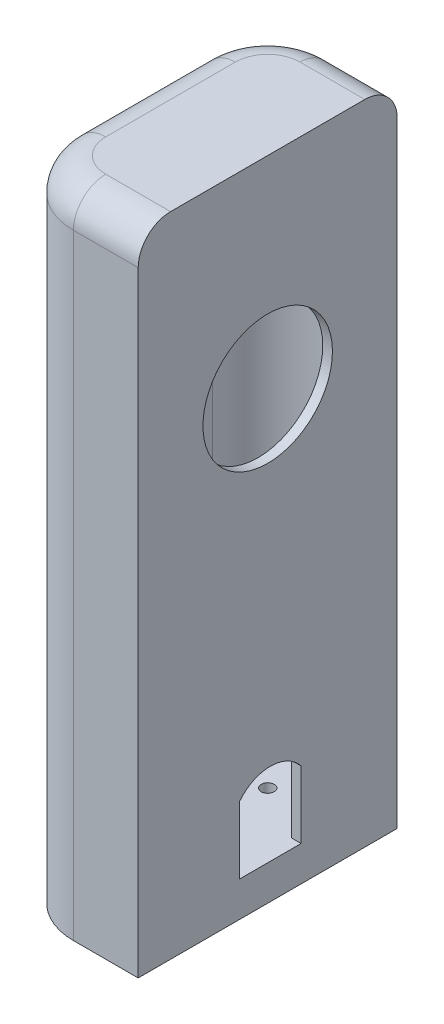
ISO-10303-21;
HEADER;
FILE_DESCRIPTION(('STEP AP214'),'2;1');
FILE_NAME('part.step','',(''),(''),'','','');
FILE_SCHEMA(('AUTOMOTIVE_DESIGN { 1 0 10303 214 1 1 1 1 }'));
ENDSEC;
DATA;
#1=APPLICATION_CONTEXT('core data for automotive mechanical design processes');
#2=APPLICATION_PROTOCOL_DEFINITION('international standard','automotive_design',2000,#1);
#3=PRODUCT_CONTEXT('',#1,'mechanical');
#4=PRODUCT('Part','Part','',(#3));
#5=PRODUCT_RELATED_PRODUCT_CATEGORY('part','',(#4));
#6=PRODUCT_DEFINITION_FORMATION('','',#4);
#7=PRODUCT_DEFINITION_CONTEXT('part definition',#1,'design');
#8=PRODUCT_DEFINITION('design','',#6,#7);
#9=PRODUCT_DEFINITION_SHAPE('','',#8);
#10=(LENGTH_UNIT() NAMED_UNIT(*) SI_UNIT(.MILLI.,.METRE.));
#11=(NAMED_UNIT(*) PLANE_ANGLE_UNIT() SI_UNIT($,.RADIAN.));
#12=(NAMED_UNIT(*) SI_UNIT($,.STERADIAN.) SOLID_ANGLE_UNIT());
#13=UNCERTAINTY_MEASURE_WITH_UNIT(LENGTH_MEASURE(1.E-05),#10,'distance_accuracy_value','');
#14=(GEOMETRIC_REPRESENTATION_CONTEXT(3) GLOBAL_UNCERTAINTY_ASSIGNED_CONTEXT((#13)) GLOBAL_UNIT_ASSIGNED_CONTEXT((#10,
#11,#12)) REPRESENTATION_CONTEXT('',''));
#15=CARTESIAN_POINT('',(0.,0.,0.));
#16=DIRECTION('',(0.,0.,1.));
#17=DIRECTION('',(1.,0.,0.));
#18=AXIS2_PLACEMENT_3D('',#15,#16,#17);
#19=CARTESIAN_POINT('',(-1.54523260009126,68.83,0.409186028532317));
#20=DIRECTION('',(1.,0.,0.));
#21=DIRECTION('',(0.,0.,-1.));
#22=AXIS2_PLACEMENT_3D('',#19,#20,#21);
#23=CYLINDRICAL_SURFACE('',#22,10.);
#24=CARTESIAN_POINT('',(5.95476739990874,68.83,0.409186028532317));
#25=DIRECTION('',(1.,0.,0.));
#26=DIRECTION('',(0.,0.,-1.));
#27=AXIS2_PLACEMENT_3D('',#24,#25,#26);
#28=CIRCLE('',#27,10.);
#29=CARTESIAN_POINT('',(5.95476739990874,68.83,-9.59081397146768));
#30=VERTEX_POINT('',#29);
#31=EDGE_CURVE('E257',#30,#30,#28,.T.);
#32=ORIENTED_EDGE('',*,*,#31,.T.);
#33=EDGE_LOOP('',(#32));
#34=FACE_BOUND('',#33,.T.);
#35=CARTESIAN_POINT('',(4.45476739990874,68.83,0.409186028532317));
#36=DIRECTION('',(-1.,0.,0.));
#37=DIRECTION('',(0.,0.,1.));
#38=AXIS2_PLACEMENT_3D('',#35,#36,#37);
#39=CIRCLE('',#38,10.);
#40=CARTESIAN_POINT('',(4.45476739990874,68.83,10.4091860285323));
#41=VERTEX_POINT('',#40);
#42=EDGE_CURVE('E217',#41,#41,#39,.F.);
#43=ORIENTED_EDGE('',*,*,#42,.F.);
#44=EDGE_LOOP('',(#43));
#45=FACE_BOUND('',#44,.T.);
#46=ADVANCED_FACE('F39',(#34,#45),#23,.F.);
#47=CARTESIAN_POINT('',(-14.0452326000913,68.83,0.409186028532317));
#48=DIRECTION('',(1.,0.,0.));
#49=DIRECTION('',(0.,0.,-1.));
#50=AXIS2_PLACEMENT_3D('',#47,#48,#49);
#51=CIRCLE('',#50,10.);
#52=CARTESIAN_POINT('',(-14.0452326000913,68.83,10.4091860285323));
#53=VERTEX_POINT('',#52);
#54=CARTESIAN_POINT('',(-14.0452326000913,68.83,-9.59081397146761));
#55=VERTEX_POINT('',#54);
#56=EDGE_CURVE('E234',#53,#55,#51,.T.);
#57=ORIENTED_EDGE('',*,*,#56,.F.);
#58=EDGE_CURVE('E237',#55,#53,#51,.T.);
#59=ORIENTED_EDGE('',*,*,#58,.F.);
#60=EDGE_LOOP('',(#57,#59));
#61=FACE_BOUND('',#60,.T.);
#62=CARTESIAN_POINT('',(-12.5452326000913,68.83,0.409186028532317));
#63=DIRECTION('',(1.,0.,0.));
#64=DIRECTION('',(0.,0.,-1.));
#65=AXIS2_PLACEMENT_3D('',#62,#63,#64);
#66=CIRCLE('',#65,10.);
#67=CARTESIAN_POINT('',(-12.5452326000913,68.83,-9.59081397146762));
#68=VERTEX_POINT('',#67);
#69=CARTESIAN_POINT('',(-12.5452326000913,68.83,10.4091860285322));
#70=VERTEX_POINT('',#69);
#71=EDGE_CURVE('E11',#68,#70,#66,.F.);
#72=ORIENTED_EDGE('',*,*,#71,.F.);
#73=EDGE_CURVE('E43',#70,#68,#66,.F.);
#74=ORIENTED_EDGE('',*,*,#73,.F.);
#75=EDGE_LOOP('',(#72,#74));
#76=FACE_BOUND('',#75,.T.);
#77=ADVANCED_FACE('F348',(#61,#76),#23,.F.);
#78=CARTESIAN_POINT('',(0.,0.,4.75));
#79=DIRECTION('',(0.,0.,-1.));
#80=DIRECTION('',(-1.,0.,0.));
#81=AXIS2_PLACEMENT_3D('',#78,#79,#80);
#82=PLANE('',#81);
#83=DIRECTION('',(1.,0.,0.));
#84=VECTOR('',#83,1.);
#85=CARTESIAN_POINT('',(3.45476739990875,5.40971585696016,4.75));
#86=LINE('',#85,#84);
#87=CARTESIAN_POINT('',(4.45476739990874,5.40971585696016,4.75));
#88=VERTEX_POINT('',#87);
#89=CARTESIAN_POINT('',(5.95476739990874,5.40971585696017,4.75));
#90=VERTEX_POINT('',#89);
#91=EDGE_CURVE('E252',#88,#90,#86,.T.);
#92=ORIENTED_EDGE('',*,*,#91,.F.);
#93=DIRECTION('',(0.,1.,0.));
#94=VECTOR('',#93,1.);
#95=CARTESIAN_POINT('',(4.45476739990874,0.,4.75));
#96=LINE('',#95,#94);
#97=CARTESIAN_POINT('',(4.45476739990875,15.7775721125282,4.75));
#98=VERTEX_POINT('',#97);
#99=EDGE_CURVE('E209',#88,#98,#96,.T.);
#100=ORIENTED_EDGE('',*,*,#99,.T.);
#101=DIRECTION('',(1.,0.,0.));
#102=VECTOR('',#101,1.);
#103=CARTESIAN_POINT('',(0.954767399908745,15.7775721125282,4.75));
#104=LINE('',#103,#102);
#105=CARTESIAN_POINT('',(5.95476739990874,15.7775721125282,4.75));
#106=VERTEX_POINT('',#105);
#107=EDGE_CURVE('E230',#98,#106,#104,.T.);
#108=ORIENTED_EDGE('',*,*,#107,.T.);
#109=DIRECTION('',(0.,-1.,0.));
#110=VECTOR('',#109,1.);
#111=CARTESIAN_POINT('',(5.95476739990874,100.,4.75));
#112=LINE('',#111,#110);
#113=EDGE_CURVE('E245',#106,#90,#112,.T.);
#114=ORIENTED_EDGE('',*,*,#113,.T.);
#115=EDGE_LOOP('',(#92,#100,#108,#114));
#116=FACE_BOUND('',#115,.T.);
#117=ADVANCED_FACE('F350',(#116),#82,.T.);
#118=CARTESIAN_POINT('',(0.,0.,-4.75));
#119=DIRECTION('',(0.,0.,-1.));
#120=DIRECTION('',(-1.,0.,0.));
#121=AXIS2_PLACEMENT_3D('',#118,#119,#120);
#122=PLANE('',#121);
#123=DIRECTION('',(0.,1.,0.));
#124=VECTOR('',#123,1.);
#125=CARTESIAN_POINT('',(4.45476739990874,0.,-4.75));
#126=LINE('',#125,#124);
#127=CARTESIAN_POINT('',(4.45476739990874,5.40971585696016,-4.75));
#128=VERTEX_POINT('',#127);
#129=CARTESIAN_POINT('',(4.45476739990875,15.7775721125282,-4.74999999999999));
#130=VERTEX_POINT('',#129);
#131=EDGE_CURVE('E62',#128,#130,#126,.T.);
#132=ORIENTED_EDGE('',*,*,#131,.F.);
#133=DIRECTION('',(1.,0.,0.));
#134=VECTOR('',#133,1.);
#135=CARTESIAN_POINT('',(3.45476739990875,5.40971585696016,-4.75));
#136=LINE('',#135,#134);
#137=CARTESIAN_POINT('',(5.95476739990874,5.40971585696017,-4.75));
#138=VERTEX_POINT('',#137);
#139=EDGE_CURVE('E255',#128,#138,#136,.T.);
#140=ORIENTED_EDGE('',*,*,#139,.T.);
#141=DIRECTION('',(0.,1.,0.));
#142=VECTOR('',#141,1.);
#143=CARTESIAN_POINT('',(5.95476739990874,100.,-4.75));
#144=LINE('',#143,#142);
#145=CARTESIAN_POINT('',(5.95476739990874,15.7775721125282,-4.74999999999999));
#146=VERTEX_POINT('',#145);
#147=EDGE_CURVE('E239',#138,#146,#144,.T.);
#148=ORIENTED_EDGE('',*,*,#147,.T.);
#149=DIRECTION('',(1.,0.,0.));
#150=VECTOR('',#149,1.);
#151=CARTESIAN_POINT('',(0.954767399908745,15.7775721125282,-4.74999999999999));
#152=LINE('',#151,#150);
#153=EDGE_CURVE('E229',#130,#146,#152,.T.);
#154=ORIENTED_EDGE('',*,*,#153,.F.);
#155=EDGE_LOOP('',(#132,#140,#148,#154));
#156=FACE_BOUND('',#155,.T.);
#157=ADVANCED_FACE('F357',(#156),#122,.F.);
#158=CARTESIAN_POINT('',(-4.04523260009126,6.,10.4091860285323));
#159=DIRECTION('',(0.,-1.,0.));
#160=DIRECTION('',(0.,0.,-1.));
#161=AXIS2_PLACEMENT_3D('',#158,#159,#160);
#162=CYLINDRICAL_SURFACE('',#161,1.);
#163=CARTESIAN_POINT('',(-4.04523260009126,0.,10.4091860285323));
#164=DIRECTION('',(0.,-1.,0.));
#165=DIRECTION('',(0.,0.,-1.));
#166=AXIS2_PLACEMENT_3D('',#163,#164,#165);
#167=CIRCLE('',#166,1.);
#168=CARTESIAN_POINT('',(-4.04523260009126,0.,9.40918602853232));
#169=VERTEX_POINT('',#168);
#170=EDGE_CURVE('E248',#169,#169,#167,.T.);
#171=ORIENTED_EDGE('',*,*,#170,.T.);
#172=EDGE_LOOP('',(#171));
#173=FACE_BOUND('',#172,.T.);
#174=CARTESIAN_POINT('',(-4.04523260009126,5.40971585696016,10.4091860285323));
#175=DIRECTION('',(0.,1.,0.));
#176=DIRECTION('',(0.,0.,1.));
#177=AXIS2_PLACEMENT_3D('',#174,#175,#176);
#178=CIRCLE('',#177,1.);
#179=CARTESIAN_POINT('',(-4.04523260009126,5.40971585696016,11.4091860285323));
#180=VERTEX_POINT('',#179);
#181=EDGE_CURVE('E223',#180,#180,#178,.F.);
#182=ORIENTED_EDGE('',*,*,#181,.F.);
#183=EDGE_LOOP('',(#182));
#184=FACE_BOUND('',#183,.T.);
#185=ADVANCED_FACE('F462',(#173,#184),#162,.F.);
#186=CARTESIAN_POINT('',(-4.04523260009126,6.,-9.59081397146768));
#187=DIRECTION('',(0.,-1.,0.));
#188=DIRECTION('',(0.,0.,-1.));
#189=AXIS2_PLACEMENT_3D('',#186,#187,#188);
#190=CYLINDRICAL_SURFACE('',#189,1.);
#191=CARTESIAN_POINT('',(-4.04523260009126,0.,-9.59081397146768));
#192=DIRECTION('',(0.,-1.,0.));
#193=DIRECTION('',(0.,0.,-1.));
#194=AXIS2_PLACEMENT_3D('',#191,#192,#193);
#195=CIRCLE('',#194,1.);
#196=CARTESIAN_POINT('',(-4.04523260009126,0.,-10.5908139714677));
#197=VERTEX_POINT('',#196);
#198=EDGE_CURVE('E249',#197,#197,#195,.T.);
#199=ORIENTED_EDGE('',*,*,#198,.T.);
#200=EDGE_LOOP('',(#199));
#201=FACE_BOUND('',#200,.T.);
#202=CARTESIAN_POINT('',(-4.04523260009126,5.40971585696016,-9.59081397146768));
#203=DIRECTION('',(0.,1.,0.));
#204=DIRECTION('',(0.,0.,1.));
#205=AXIS2_PLACEMENT_3D('',#202,#203,#204);
#206=CIRCLE('',#205,1.);
#207=CARTESIAN_POINT('',(-4.04523260009126,5.40971585696016,-8.59081397146768));
#208=VERTEX_POINT('',#207);
#209=EDGE_CURVE('E220',#208,#208,#206,.F.);
#210=ORIENTED_EDGE('',*,*,#209,.F.);
#211=EDGE_LOOP('',(#210));
#212=FACE_BOUND('',#211,.T.);
#213=ADVANCED_FACE('F456',(#201,#212),#190,.F.);
#214=CARTESIAN_POINT('',(-16.3282200888741,12.1162414245237,0.));
#215=DIRECTION('',(1.,0.,0.));
#216=DIRECTION('',(0.,0.,-1.));
#217=AXIS2_PLACEMENT_3D('',#214,#215,#216);
#218=CYLINDRICAL_SURFACE('',#217,5.99731960186579);
#219=CARTESIAN_POINT('',(4.45476739990875,12.1162414245237,0.));
#220=DIRECTION('',(-1.,0.,0.));
#221=DIRECTION('',(0.,0.,1.));
#222=AXIS2_PLACEMENT_3D('',#219,#220,#221);
#223=CIRCLE('',#222,5.99731960186579);
#224=EDGE_CURVE('E321',#130,#98,#223,.F.);
#225=ORIENTED_EDGE('',*,*,#224,.F.);
#226=ORIENTED_EDGE('',*,*,#153,.T.);
#227=CARTESIAN_POINT('',(5.95476739990874,12.1162414245237,0.));
#228=DIRECTION('',(1.,0.,0.));
#229=DIRECTION('',(0.,0.,1.));
#230=AXIS2_PLACEMENT_3D('',#227,#228,#229);
#231=CIRCLE('',#230,5.99731960186579);
#232=EDGE_CURVE('E226',#146,#106,#231,.T.);
#233=ORIENTED_EDGE('',*,*,#232,.T.);
#234=ORIENTED_EDGE('',*,*,#107,.F.);
#235=EDGE_LOOP('',(#225,#226,#233,#234));
#236=FACE_BOUND('',#235,.T.);
#237=ADVANCED_FACE('F452',(#236),#218,.F.);
#238=CARTESIAN_POINT('',(-14.0452326000913,100.,0.));
#239=DIRECTION('',(1.,0.,0.));
#240=DIRECTION('',(0.,0.,-1.));
#241=AXIS2_PLACEMENT_3D('',#238,#239,#240);
#242=PLANE('',#241);
#243=DIRECTION('',(0.,-1.,0.));
#244=VECTOR('',#243,1.);
#245=CARTESIAN_POINT('',(-14.0452326000913,100.,10.4091860285323));
#246=LINE('',#245,#244);
#247=CARTESIAN_POINT('',(-14.0452326000913,95.,10.4091860285323));
#248=VERTEX_POINT('',#247);
#249=EDGE_CURVE('E289',#248,#53,#246,.T.);
#250=ORIENTED_EDGE('',*,*,#249,.F.);
#251=DIRECTION('',(0.,0.,1.));
#252=VECTOR('',#251,1.);
#253=CARTESIAN_POINT('',(-14.0452326000913,95.,-9.59081397146761));
#254=LINE('',#253,#252);
#255=CARTESIAN_POINT('',(-14.0452326000913,95.,-9.59081397146761));
#256=VERTEX_POINT('',#255);
#257=EDGE_CURVE('E319',#248,#256,#254,.F.);
#258=ORIENTED_EDGE('',*,*,#257,.T.);
#259=DIRECTION('',(0.,-1.,0.));
#260=VECTOR('',#259,1.);
#261=CARTESIAN_POINT('',(-14.0452326000913,100.,-9.59081397146761));
#262=LINE('',#261,#260);
#263=EDGE_CURVE('E292',#256,#55,#262,.T.);
#264=ORIENTED_EDGE('',*,*,#263,.T.);
#265=ORIENTED_EDGE('',*,*,#58,.T.);
#266=EDGE_LOOP('',(#250,#258,#264,#265));
#267=FACE_BOUND('',#266,.T.);
#268=ADVANCED_FACE('F378',(#267),#242,.F.);
#269=CARTESIAN_POINT('',(5.95476739990874,100.,0.));
#270=DIRECTION('',(1.,0.,0.));
#271=DIRECTION('',(0.,0.,-1.));
#272=AXIS2_PLACEMENT_3D('',#269,#270,#271);
#273=PLANE('',#272);
#274=ORIENTED_EDGE('',*,*,#232,.F.);
#275=ORIENTED_EDGE('',*,*,#147,.F.);
#276=DIRECTION('',(0.,0.,-1.));
#277=VECTOR('',#276,1.);
#278=CARTESIAN_POINT('',(5.95476739990874,5.40971585696017,0.));
#279=LINE('',#278,#277);
#280=EDGE_CURVE('E242',#90,#138,#279,.T.);
#281=ORIENTED_EDGE('',*,*,#280,.F.);
#282=ORIENTED_EDGE('',*,*,#113,.F.);
#283=EDGE_LOOP('',(#274,#275,#281,#282));
#284=FACE_BOUND('',#283,.T.);
#285=ORIENTED_EDGE('',*,*,#31,.F.);
#286=EDGE_LOOP('',(#285));
#287=FACE_BOUND('',#286,.T.);
#288=DIRECTION('',(0.,-1.,0.));
#289=VECTOR('',#288,1.);
#290=CARTESIAN_POINT('',(5.95476739990873,100.,-19.5908139714677));
#291=LINE('',#290,#289);
#292=CARTESIAN_POINT('',(5.95476739990873,95.,-19.5908139714677));
#293=VERTEX_POINT('',#292);
#294=CARTESIAN_POINT('',(5.95476739990873,0.,-19.5908139714677));
#295=VERTEX_POINT('',#294);
#296=EDGE_CURVE('E265',#293,#295,#291,.T.);
#297=ORIENTED_EDGE('',*,*,#296,.F.);
#298=CARTESIAN_POINT('',(5.95476739990874,95.,-14.5908139714677));
#299=DIRECTION('',(1.,0.,0.));
#300=DIRECTION('',(0.,0.,-1.));
#301=AXIS2_PLACEMENT_3D('',#298,#299,#300);
#302=CIRCLE('',#301,5.);
#303=CARTESIAN_POINT('',(5.95476739990874,100.,-14.5908139714677));
#304=VERTEX_POINT('',#303);
#305=EDGE_CURVE('E301',#293,#304,#302,.T.);
#306=ORIENTED_EDGE('',*,*,#305,.T.);
#307=DIRECTION('',(0.,0.,1.));
#308=VECTOR('',#307,1.);
#309=CARTESIAN_POINT('',(5.95476739990874,100.,0.));
#310=LINE('',#309,#308);
#311=CARTESIAN_POINT('',(5.95476739990874,100.,15.4091860285323));
#312=VERTEX_POINT('',#311);
#313=EDGE_CURVE('E262',#304,#312,#310,.T.);
#314=ORIENTED_EDGE('',*,*,#313,.T.);
#315=CARTESIAN_POINT('',(5.95476739990874,95.,15.4091860285323));
#316=DIRECTION('',(1.,0.,0.));
#317=DIRECTION('',(0.,0.,-1.));
#318=AXIS2_PLACEMENT_3D('',#315,#316,#317);
#319=CIRCLE('',#318,5.);
#320=CARTESIAN_POINT('',(5.95476739990874,95.,20.4091860285323));
#321=VERTEX_POINT('',#320);
#322=EDGE_CURVE('E299',#312,#321,#319,.T.);
#323=ORIENTED_EDGE('',*,*,#322,.T.);
#324=DIRECTION('',(0.,-1.,0.));
#325=VECTOR('',#324,1.);
#326=CARTESIAN_POINT('',(5.95476739990874,100.,20.4091860285323));
#327=LINE('',#326,#325);
#328=CARTESIAN_POINT('',(5.95476739990874,0.,20.4091860285323));
#329=VERTEX_POINT('',#328);
#330=EDGE_CURVE('E284',#321,#329,#327,.T.);
#331=ORIENTED_EDGE('',*,*,#330,.T.);
#332=DIRECTION('',(0.,0.,1.));
#333=VECTOR('',#332,1.);
#334=CARTESIAN_POINT('',(5.95476739990874,0.,0.));
#335=LINE('',#334,#333);
#336=EDGE_CURVE('E266',#295,#329,#335,.T.);
#337=ORIENTED_EDGE('',*,*,#336,.F.);
#338=EDGE_LOOP('',(#297,#306,#314,#323,#331,#337));
#339=FACE_BOUND('',#338,.T.);
#340=ADVANCED_FACE('F374',(#284,#287,#339),#273,.T.);
#341=CARTESIAN_POINT('',(0.,100.,-19.5908139714677));
#342=DIRECTION('',(0.,0.,-1.));
#343=DIRECTION('',(-1.,0.,0.));
#344=AXIS2_PLACEMENT_3D('',#341,#342,#343);
#345=PLANE('',#344);
#346=DIRECTION('',(0.,-1.,0.));
#347=VECTOR('',#346,1.);
#348=CARTESIAN_POINT('',(-4.04523260009119,100.,-19.5908139714677));
#349=LINE('',#348,#347);
#350=CARTESIAN_POINT('',(-4.04523260009119,95.,-19.5908139714677));
#351=VERTEX_POINT('',#350);
#352=CARTESIAN_POINT('',(-4.04523260009119,0.,-19.5908139714677));
#353=VERTEX_POINT('',#352);
#354=EDGE_CURVE('E294',#351,#353,#349,.T.);
#355=ORIENTED_EDGE('',*,*,#354,.F.);
#356=DIRECTION('',(1.,0.,0.));
#357=VECTOR('',#356,1.);
#358=CARTESIAN_POINT('',(0.,95.,-19.5908139714677));
#359=LINE('',#358,#357);
#360=EDGE_CURVE('E296',#351,#293,#359,.T.);
#361=ORIENTED_EDGE('',*,*,#360,.T.);
#362=ORIENTED_EDGE('',*,*,#296,.T.);
#363=DIRECTION('',(1.,0.,0.));
#364=VECTOR('',#363,1.);
#365=CARTESIAN_POINT('',(0.,0.,-19.5908139714677));
#366=LINE('',#365,#364);
#367=EDGE_CURVE('E261',#353,#295,#366,.T.);
#368=ORIENTED_EDGE('',*,*,#367,.F.);
#369=EDGE_LOOP('',(#355,#361,#362,#368));
#370=FACE_BOUND('',#369,.T.);
#371=ADVANCED_FACE('F377',(#370),#345,.T.);
#372=CARTESIAN_POINT('',(-4.04523260009126,100.,-9.59081397146768));
#373=DIRECTION('',(0.,-1.,0.));
#374=DIRECTION('',(0.,0.,-1.));
#375=AXIS2_PLACEMENT_3D('',#372,#373,#374);
#376=CYLINDRICAL_SURFACE('',#375,10.);
#377=ORIENTED_EDGE('',*,*,#263,.F.);
#378=CARTESIAN_POINT('',(-4.04523260009126,95.,-9.59081397146768));
#379=DIRECTION('',(0.,1.,0.));
#380=DIRECTION('',(0.,0.,1.));
#381=AXIS2_PLACEMENT_3D('',#378,#379,#380);
#382=CIRCLE('',#381,10.);
#383=EDGE_CURVE('E313',#256,#351,#382,.F.);
#384=ORIENTED_EDGE('',*,*,#383,.T.);
#385=ORIENTED_EDGE('',*,*,#354,.T.);
#386=CARTESIAN_POINT('',(-4.04523260009126,0.,-9.59081397146768));
#387=DIRECTION('',(0.,1.,0.));
#388=DIRECTION('',(0.,0.,1.));
#389=AXIS2_PLACEMENT_3D('',#386,#387,#388);
#390=CIRCLE('',#389,10.);
#391=CARTESIAN_POINT('',(-14.0452326000913,0.,-9.59081397146761));
#392=VERTEX_POINT('',#391);
#393=EDGE_CURVE('E269',#353,#392,#390,.T.);
#394=ORIENTED_EDGE('',*,*,#393,.T.);
#395=EDGE_CURVE('E291',#55,#392,#262,.T.);
#396=ORIENTED_EDGE('',*,*,#395,.F.);
#397=EDGE_LOOP('',(#377,#384,#385,#394,#396));
#398=FACE_BOUND('',#397,.T.);
#399=ADVANCED_FACE('F390',(#398),#376,.T.);
#400=CARTESIAN_POINT('',(-14.0452326000913,0.,10.4091860285323));
#401=VERTEX_POINT('',#400);
#402=EDGE_CURVE('E288',#53,#401,#246,.T.);
#403=ORIENTED_EDGE('',*,*,#402,.F.);
#404=ORIENTED_EDGE('',*,*,#56,.T.);
#405=ORIENTED_EDGE('',*,*,#395,.T.);
#406=DIRECTION('',(0.,0.,1.));
#407=VECTOR('',#406,1.);
#408=CARTESIAN_POINT('',(-14.0452326000913,0.,0.));
#409=LINE('',#408,#407);
#410=EDGE_CURVE('E272',#392,#401,#409,.T.);
#411=ORIENTED_EDGE('',*,*,#410,.T.);
#412=EDGE_LOOP('',(#403,#404,#405,#411));
#413=FACE_BOUND('',#412,.T.);
#414=ADVANCED_FACE('F386',(#413),#242,.F.);
#415=CARTESIAN_POINT('',(-4.04523260009126,100.,10.4091860285323));
#416=DIRECTION('',(0.,-1.,0.));
#417=DIRECTION('',(0.,0.,-1.));
#418=AXIS2_PLACEMENT_3D('',#415,#416,#417);
#419=CYLINDRICAL_SURFACE('',#418,10.);
#420=DIRECTION('',(0.,-1.,0.));
#421=VECTOR('',#420,1.);
#422=CARTESIAN_POINT('',(-4.04523260009119,100.,20.4091860285323));
#423=LINE('',#422,#421);
#424=CARTESIAN_POINT('',(-4.04523260009119,95.,20.4091860285323));
#425=VERTEX_POINT('',#424);
#426=CARTESIAN_POINT('',(-4.04523260009119,0.,20.4091860285323));
#427=VERTEX_POINT('',#426);
#428=EDGE_CURVE('E286',#425,#427,#423,.T.);
#429=ORIENTED_EDGE('',*,*,#428,.F.);
#430=CARTESIAN_POINT('',(-4.04523260009126,95.,10.4091860285323));
#431=DIRECTION('',(0.,1.,0.));
#432=DIRECTION('',(0.,0.,1.));
#433=AXIS2_PLACEMENT_3D('',#430,#431,#432);
#434=CIRCLE('',#433,10.);
#435=EDGE_CURVE('E317',#425,#248,#434,.F.);
#436=ORIENTED_EDGE('',*,*,#435,.T.);
#437=ORIENTED_EDGE('',*,*,#249,.T.);
#438=ORIENTED_EDGE('',*,*,#402,.T.);
#439=CARTESIAN_POINT('',(-4.04523260009126,0.,10.4091860285323));
#440=DIRECTION('',(0.,1.,0.));
#441=DIRECTION('',(0.,0.,1.));
#442=AXIS2_PLACEMENT_3D('',#439,#440,#441);
#443=CIRCLE('',#442,10.);
#444=EDGE_CURVE('E275',#401,#427,#443,.T.);
#445=ORIENTED_EDGE('',*,*,#444,.T.);
#446=EDGE_LOOP('',(#429,#436,#437,#438,#445));
#447=FACE_BOUND('',#446,.T.);
#448=ADVANCED_FACE('F382',(#447),#419,.T.);
#449=CARTESIAN_POINT('',(0.,100.,20.4091860285323));
#450=DIRECTION('',(0.,0.,-1.));
#451=DIRECTION('',(-1.,0.,0.));
#452=AXIS2_PLACEMENT_3D('',#449,#450,#451);
#453=PLANE('',#452);
#454=ORIENTED_EDGE('',*,*,#330,.F.);
#455=DIRECTION('',(1.,0.,0.));
#456=VECTOR('',#455,1.);
#457=CARTESIAN_POINT('',(-4.04523260009119,95.,20.4091860285323));
#458=LINE('',#457,#456);
#459=EDGE_CURVE('E315',#321,#425,#458,.F.);
#460=ORIENTED_EDGE('',*,*,#459,.T.);
#461=ORIENTED_EDGE('',*,*,#428,.T.);
#462=DIRECTION('',(1.,0.,0.));
#463=VECTOR('',#462,1.);
#464=CARTESIAN_POINT('',(0.,0.,20.4091860285323));
#465=LINE('',#464,#463);
#466=EDGE_CURVE('E278',#427,#329,#465,.T.);
#467=ORIENTED_EDGE('',*,*,#466,.T.);
#468=EDGE_LOOP('',(#454,#460,#461,#467));
#469=FACE_BOUND('',#468,.T.);
#470=ADVANCED_FACE('F369',(#469),#453,.F.);
#471=CARTESIAN_POINT('',(0.,100.,0.));
#472=DIRECTION('',(0.,1.,0.));
#473=DIRECTION('',(0.,0.,1.));
#474=AXIS2_PLACEMENT_3D('',#471,#472,#473);
#475=PLANE('',#474);
#476=ORIENTED_EDGE('',*,*,#313,.F.);
#477=DIRECTION('',(1.,0.,0.));
#478=VECTOR('',#477,1.);
#479=CARTESIAN_POINT('',(0.,100.,-14.5908139714677));
#480=LINE('',#479,#478);
#481=CARTESIAN_POINT('',(-4.04523260009119,100.,-14.5908139714677));
#482=VERTEX_POINT('',#481);
#483=EDGE_CURVE('E311',#304,#482,#480,.F.);
#484=ORIENTED_EDGE('',*,*,#483,.T.);
#485=CARTESIAN_POINT('',(-4.04523260009126,100.,-9.59081397146768));
#486=DIRECTION('',(0.,1.,0.));
#487=DIRECTION('',(0.,0.,1.));
#488=AXIS2_PLACEMENT_3D('',#485,#486,#487);
#489=CIRCLE('',#488,5.);
#490=CARTESIAN_POINT('',(-9.04523260009126,100.,-9.59081397146764));
#491=VERTEX_POINT('',#490);
#492=EDGE_CURVE('E309',#482,#491,#489,.T.);
#493=ORIENTED_EDGE('',*,*,#492,.T.);
#494=DIRECTION('',(0.,0.,1.));
#495=VECTOR('',#494,1.);
#496=CARTESIAN_POINT('',(-9.04523260009126,100.,10.4091860285323));
#497=LINE('',#496,#495);
#498=CARTESIAN_POINT('',(-9.04523260009126,100.,10.4091860285323));
#499=VERTEX_POINT('',#498);
#500=EDGE_CURVE('E303',#491,#499,#497,.T.);
#501=ORIENTED_EDGE('',*,*,#500,.T.);
#502=CARTESIAN_POINT('',(-4.04523260009126,100.,10.4091860285323));
#503=DIRECTION('',(0.,1.,0.));
#504=DIRECTION('',(0.,0.,1.));
#505=AXIS2_PLACEMENT_3D('',#502,#503,#504);
#506=CIRCLE('',#505,5.);
#507=CARTESIAN_POINT('',(-4.04523260009119,100.,15.4091860285323));
#508=VERTEX_POINT('',#507);
#509=EDGE_CURVE('E305',#499,#508,#506,.T.);
#510=ORIENTED_EDGE('',*,*,#509,.T.);
#511=DIRECTION('',(1.,0.,0.));
#512=VECTOR('',#511,1.);
#513=CARTESIAN_POINT('',(5.95476739990874,100.,15.4091860285323));
#514=LINE('',#513,#512);
#515=EDGE_CURVE('E307',#508,#312,#514,.T.);
#516=ORIENTED_EDGE('',*,*,#515,.T.);
#517=EDGE_LOOP('',(#476,#484,#493,#501,#510,#516));
#518=FACE_BOUND('',#517,.T.);
#519=ADVANCED_FACE('F365',(#518),#475,.T.);
#520=CARTESIAN_POINT('',(0.,0.,0.));
#521=DIRECTION('',(0.,1.,0.));
#522=DIRECTION('',(0.,0.,1.));
#523=AXIS2_PLACEMENT_3D('',#520,#521,#522);
#524=PLANE('',#523);
#525=ORIENTED_EDGE('',*,*,#198,.F.);
#526=EDGE_LOOP('',(#525));
#527=FACE_BOUND('',#526,.T.);
#528=ORIENTED_EDGE('',*,*,#170,.F.);
#529=EDGE_LOOP('',(#528));
#530=FACE_BOUND('',#529,.T.);
#531=ORIENTED_EDGE('',*,*,#367,.T.);
#532=ORIENTED_EDGE('',*,*,#336,.T.);
#533=ORIENTED_EDGE('',*,*,#466,.F.);
#534=ORIENTED_EDGE('',*,*,#444,.F.);
#535=ORIENTED_EDGE('',*,*,#410,.F.);
#536=ORIENTED_EDGE('',*,*,#393,.F.);
#537=EDGE_LOOP('',(#531,#532,#533,#534,#535,#536));
#538=FACE_BOUND('',#537,.T.);
#539=ADVANCED_FACE('F368',(#527,#530,#538),#524,.F.);
#540=CARTESIAN_POINT('',(3.45476739990875,5.40971585696016,-4.75));
#541=DIRECTION('',(0.,-1.,0.));
#542=DIRECTION('',(0.,0.,-1.));
#543=AXIS2_PLACEMENT_3D('',#540,#541,#542);
#544=PLANE('',#543);
#545=DIRECTION('',(0.,0.,-1.));
#546=VECTOR('',#545,1.);
#547=CARTESIAN_POINT('',(4.45476739990874,5.40971585696016,0.));
#548=LINE('',#547,#546);
#549=CARTESIAN_POINT('',(4.45476739990874,5.40971585696016,18.9091860285323));
#550=VERTEX_POINT('',#549);
#551=EDGE_CURVE('E488',#550,#88,#548,.T.);
#552=ORIENTED_EDGE('',*,*,#551,.T.);
#553=ORIENTED_EDGE('',*,*,#91,.T.);
#554=ORIENTED_EDGE('',*,*,#280,.T.);
#555=ORIENTED_EDGE('',*,*,#139,.F.);
#556=CARTESIAN_POINT('',(4.45476739990874,5.40971585696016,-18.0908139714677));
#557=VERTEX_POINT('',#556);
#558=EDGE_CURVE('E480',#128,#557,#548,.T.);
#559=ORIENTED_EDGE('',*,*,#558,.T.);
#560=DIRECTION('',(-1.,0.,0.));
#561=VECTOR('',#560,1.);
#562=CARTESIAN_POINT('',(0.,5.40971585696016,-18.0908139714677));
#563=LINE('',#562,#561);
#564=CARTESIAN_POINT('',(-4.04523260009119,5.40971585696016,-18.0908139714677));
#565=VERTEX_POINT('',#564);
#566=EDGE_CURVE('E206',#557,#565,#563,.T.);
#567=ORIENTED_EDGE('',*,*,#566,.T.);
#568=CARTESIAN_POINT('',(-4.04523260009126,5.40971585696016,-9.59081397146768));
#569=DIRECTION('',(0.,1.,0.));
#570=DIRECTION('',(0.,0.,1.));
#571=AXIS2_PLACEMENT_3D('',#568,#569,#570);
#572=CIRCLE('',#571,8.5);
#573=CARTESIAN_POINT('',(-12.5452326000913,5.40971585696016,-9.59081397146762));
#574=VERTEX_POINT('',#573);
#575=EDGE_CURVE('E491',#565,#574,#572,.T.);
#576=ORIENTED_EDGE('',*,*,#575,.T.);
#577=DIRECTION('',(0.,0.,1.));
#578=VECTOR('',#577,1.);
#579=CARTESIAN_POINT('',(-12.5452326000913,5.40971585696016,0.));
#580=LINE('',#579,#578);
#581=CARTESIAN_POINT('',(-12.5452326000913,5.40971585696016,10.4091860285323));
#582=VERTEX_POINT('',#581);
#583=EDGE_CURVE('E343',#574,#582,#580,.T.);
#584=ORIENTED_EDGE('',*,*,#583,.T.);
#585=CARTESIAN_POINT('',(-4.04523260009126,5.40971585696016,10.4091860285323));
#586=DIRECTION('',(0.,1.,0.));
#587=DIRECTION('',(0.,0.,1.));
#588=AXIS2_PLACEMENT_3D('',#585,#586,#587);
#589=CIRCLE('',#588,8.5);
#590=CARTESIAN_POINT('',(-4.04523260009121,5.40971585696016,18.9091860285323));
#591=VERTEX_POINT('',#590);
#592=EDGE_CURVE('E499',#582,#591,#589,.T.);
#593=ORIENTED_EDGE('',*,*,#592,.T.);
#594=DIRECTION('',(1.,0.,0.));
#595=VECTOR('',#594,1.);
#596=CARTESIAN_POINT('',(0.,5.40971585696016,18.9091860285323));
#597=LINE('',#596,#595);
#598=EDGE_CURVE('E202',#591,#550,#597,.T.);
#599=ORIENTED_EDGE('',*,*,#598,.T.);
#600=EDGE_LOOP('',(#552,#553,#554,#555,#559,#567,#576,#584,#593,#599));
#601=FACE_BOUND('',#600,.T.);
#602=ORIENTED_EDGE('',*,*,#209,.T.);
#603=EDGE_LOOP('',(#602));
#604=FACE_BOUND('',#603,.T.);
#605=ORIENTED_EDGE('',*,*,#181,.T.);
#606=EDGE_LOOP('',(#605));
#607=FACE_BOUND('',#606,.T.);
#608=ADVANCED_FACE('F364',(#601,#604,#607),#544,.F.);
#609=CARTESIAN_POINT('',(0.,95.,15.4091860285323));
#610=DIRECTION('',(-1.,0.,0.));
#611=DIRECTION('',(0.,0.,1.));
#612=AXIS2_PLACEMENT_3D('',#609,#610,#611);
#613=CYLINDRICAL_SURFACE('',#612,5.);
#614=ORIENTED_EDGE('',*,*,#322,.F.);
#615=ORIENTED_EDGE('',*,*,#515,.F.);
#616=CARTESIAN_POINT('',(-4.04523260009119,95.,15.4091860285323));
#617=DIRECTION('',(-1.,0.,0.));
#618=DIRECTION('',(0.,0.,1.));
#619=AXIS2_PLACEMENT_3D('',#616,#617,#618);
#620=CIRCLE('',#619,5.);
#621=EDGE_CURVE('E238',#425,#508,#620,.T.);
#622=ORIENTED_EDGE('',*,*,#621,.F.);
#623=ORIENTED_EDGE('',*,*,#459,.F.);
#624=EDGE_LOOP('',(#614,#615,#622,#623));
#625=FACE_BOUND('',#624,.T.);
#626=ADVANCED_FACE('F41',(#625),#613,.T.);
#627=CARTESIAN_POINT('',(-4.04523260009126,95.,10.4091860285323));
#628=DIRECTION('',(0.,1.,0.));
#629=DIRECTION('',(0.,0.,1.));
#630=AXIS2_PLACEMENT_3D('',#627,#628,#629);
#631=DEGENERATE_TOROIDAL_SURFACE('',#630,5.,5.,.T.);
#632=ORIENTED_EDGE('',*,*,#621,.T.);
#633=ORIENTED_EDGE('',*,*,#509,.F.);
#634=CARTESIAN_POINT('',(-9.04523260009126,95.,10.4091860285323));
#635=DIRECTION('',(0.,0.,-1.));
#636=DIRECTION('',(-1.,0.,0.));
#637=AXIS2_PLACEMENT_3D('',#634,#635,#636);
#638=CIRCLE('',#637,5.);
#639=EDGE_CURVE('E327',#248,#499,#638,.T.);
#640=ORIENTED_EDGE('',*,*,#639,.F.);
#641=ORIENTED_EDGE('',*,*,#435,.F.);
#642=EDGE_LOOP('',(#632,#633,#640,#641));
#643=FACE_BOUND('',#642,.T.);
#644=ADVANCED_FACE('F408',(#643),#631,.T.);
#645=CARTESIAN_POINT('',(-9.04523260009126,95.,0.));
#646=DIRECTION('',(0.,0.,-1.));
#647=DIRECTION('',(-1.,0.,0.));
#648=AXIS2_PLACEMENT_3D('',#645,#646,#647);
#649=CYLINDRICAL_SURFACE('',#648,5.);
#650=ORIENTED_EDGE('',*,*,#639,.T.);
#651=ORIENTED_EDGE('',*,*,#500,.F.);
#652=CARTESIAN_POINT('',(-9.04523260009126,95.,-9.59081397146761));
#653=DIRECTION('',(0.,0.,-1.));
#654=DIRECTION('',(0.,1.,0.));
#655=AXIS2_PLACEMENT_3D('',#652,#653,#654);
#656=CIRCLE('',#655,5.);
#657=EDGE_CURVE('E324',#256,#491,#656,.T.);
#658=ORIENTED_EDGE('',*,*,#657,.F.);
#659=ORIENTED_EDGE('',*,*,#257,.F.);
#660=EDGE_LOOP('',(#650,#651,#658,#659));
#661=FACE_BOUND('',#660,.T.);
#662=ADVANCED_FACE('F405',(#661),#649,.T.);
#663=CARTESIAN_POINT('',(-4.04523260009126,95.,-9.59081397146768));
#664=DIRECTION('',(0.,1.,0.));
#665=DIRECTION('',(0.,0.,1.));
#666=AXIS2_PLACEMENT_3D('',#663,#664,#665);
#667=DEGENERATE_TOROIDAL_SURFACE('',#666,5.,5.,.T.);
#668=ORIENTED_EDGE('',*,*,#657,.T.);
#669=ORIENTED_EDGE('',*,*,#492,.F.);
#670=CARTESIAN_POINT('',(-4.04523260009123,95.,-14.5908139714677));
#671=DIRECTION('',(1.,0.,0.));
#672=DIRECTION('',(0.,0.,-1.));
#673=AXIS2_PLACEMENT_3D('',#670,#671,#672);
#674=CIRCLE('',#673,5.);
#675=EDGE_CURVE('E232',#351,#482,#674,.T.);
#676=ORIENTED_EDGE('',*,*,#675,.F.);
#677=ORIENTED_EDGE('',*,*,#383,.F.);
#678=EDGE_LOOP('',(#668,#669,#676,#677));
#679=FACE_BOUND('',#678,.T.);
#680=ADVANCED_FACE('F401',(#679),#667,.T.);
#681=CARTESIAN_POINT('',(0.,95.,-14.5908139714677));
#682=DIRECTION('',(1.,0.,0.));
#683=DIRECTION('',(0.,0.,-1.));
#684=AXIS2_PLACEMENT_3D('',#681,#682,#683);
#685=CYLINDRICAL_SURFACE('',#684,5.);
#686=ORIENTED_EDGE('',*,*,#675,.T.);
#687=ORIENTED_EDGE('',*,*,#483,.F.);
#688=ORIENTED_EDGE('',*,*,#305,.F.);
#689=ORIENTED_EDGE('',*,*,#360,.F.);
#690=EDGE_LOOP('',(#686,#687,#688,#689));
#691=FACE_BOUND('',#690,.T.);
#692=ADVANCED_FACE('F398',(#691),#685,.T.);
#693=CARTESIAN_POINT('',(-12.5452326000913,95.4097158569602,0.));
#694=DIRECTION('',(1.,0.,0.));
#695=DIRECTION('',(0.,0.,-1.));
#696=AXIS2_PLACEMENT_3D('',#693,#694,#695);
#697=PLANE('',#696);
#698=ORIENTED_EDGE('',*,*,#71,.T.);
#699=DIRECTION('',(0.,-1.,0.));
#700=VECTOR('',#699,1.);
#701=CARTESIAN_POINT('',(-12.5452326000913,95.4097158569602,10.4091860285323));
#702=LINE('',#701,#700);
#703=EDGE_CURVE('E506',#70,#582,#702,.T.);
#704=ORIENTED_EDGE('',*,*,#703,.T.);
#705=ORIENTED_EDGE('',*,*,#583,.F.);
#706=DIRECTION('',(0.,-1.,0.));
#707=VECTOR('',#706,1.);
#708=CARTESIAN_POINT('',(-12.5452326000913,95.4097158569602,-9.59081397146762));
#709=LINE('',#708,#707);
#710=EDGE_CURVE('E340',#68,#574,#709,.T.);
#711=ORIENTED_EDGE('',*,*,#710,.F.);
#712=EDGE_LOOP('',(#698,#704,#705,#711));
#713=FACE_BOUND('',#712,.T.);
#714=ADVANCED_FACE('F341',(#713),#697,.T.);
#715=ORIENTED_EDGE('',*,*,#73,.T.);
#716=CARTESIAN_POINT('',(-12.5452326000913,95.4097158569602,-9.59081397146762));
#717=VERTEX_POINT('',#716);
#718=EDGE_CURVE('E211',#717,#68,#709,.T.);
#719=ORIENTED_EDGE('',*,*,#718,.F.);
#720=DIRECTION('',(0.,0.,1.));
#721=VECTOR('',#720,1.);
#722=CARTESIAN_POINT('',(-12.5452326000913,95.4097158569602,0.));
#723=LINE('',#722,#721);
#724=CARTESIAN_POINT('',(-12.5452326000913,95.4097158569602,10.4091860285323));
#725=VERTEX_POINT('',#724);
#726=EDGE_CURVE('E515',#717,#725,#723,.T.);
#727=ORIENTED_EDGE('',*,*,#726,.T.);
#728=EDGE_CURVE('E54',#725,#70,#702,.T.);
#729=ORIENTED_EDGE('',*,*,#728,.T.);
#730=EDGE_LOOP('',(#715,#719,#727,#729));
#731=FACE_BOUND('',#730,.T.);
#732=ADVANCED_FACE('F334',(#731),#697,.T.);
#733=CARTESIAN_POINT('',(4.45476739990874,95.4097158569602,0.));
#734=DIRECTION('',(-1.,0.,0.));
#735=DIRECTION('',(0.,0.,1.));
#736=AXIS2_PLACEMENT_3D('',#733,#734,#735);
#737=PLANE('',#736);
#738=ORIENTED_EDGE('',*,*,#551,.F.);
#739=DIRECTION('',(0.,-1.,0.));
#740=VECTOR('',#739,1.);
#741=CARTESIAN_POINT('',(4.45476739990874,95.4097158569602,18.9091860285323));
#742=LINE('',#741,#740);
#743=CARTESIAN_POINT('',(4.45476739990874,95.4097158569602,18.9091860285323));
#744=VERTEX_POINT('',#743);
#745=EDGE_CURVE('E201',#744,#550,#742,.T.);
#746=ORIENTED_EDGE('',*,*,#745,.F.);
#747=DIRECTION('',(0.,0.,-1.));
#748=VECTOR('',#747,1.);
#749=CARTESIAN_POINT('',(4.45476739990874,95.4097158569602,0.));
#750=LINE('',#749,#748);
#751=CARTESIAN_POINT('',(4.45476739990874,95.4097158569602,-18.0908139714677));
#752=VERTEX_POINT('',#751);
#753=EDGE_CURVE('E186',#744,#752,#750,.T.);
#754=ORIENTED_EDGE('',*,*,#753,.T.);
#755=DIRECTION('',(0.,-1.,0.));
#756=VECTOR('',#755,1.);
#757=CARTESIAN_POINT('',(4.45476739990874,95.4097158569602,-18.0908139714677));
#758=LINE('',#757,#756);
#759=EDGE_CURVE('E199',#752,#557,#758,.T.);
#760=ORIENTED_EDGE('',*,*,#759,.T.);
#761=ORIENTED_EDGE('',*,*,#558,.F.);
#762=ORIENTED_EDGE('',*,*,#131,.T.);
#763=ORIENTED_EDGE('',*,*,#224,.T.);
#764=ORIENTED_EDGE('',*,*,#99,.F.);
#765=EDGE_LOOP('',(#738,#746,#754,#760,#761,#762,#763,#764));
#766=FACE_BOUND('',#765,.T.);
#767=ORIENTED_EDGE('',*,*,#42,.T.);
#768=EDGE_LOOP('',(#767));
#769=FACE_BOUND('',#768,.T.);
#770=ADVANCED_FACE('F197',(#766,#769),#737,.T.);
#771=CARTESIAN_POINT('',(0.,95.4097158569602,-18.0908139714677));
#772=DIRECTION('',(0.,0.,1.));
#773=DIRECTION('',(1.,0.,0.));
#774=AXIS2_PLACEMENT_3D('',#771,#772,#773);
#775=PLANE('',#774);
#776=ORIENTED_EDGE('',*,*,#566,.F.);
#777=ORIENTED_EDGE('',*,*,#759,.F.);
#778=DIRECTION('',(-1.,0.,0.));
#779=VECTOR('',#778,1.);
#780=CARTESIAN_POINT('',(0.,95.4097158569602,-18.0908139714677));
#781=LINE('',#780,#779);
#782=CARTESIAN_POINT('',(-4.04523260009119,95.4097158569602,-18.0908139714677));
#783=VERTEX_POINT('',#782);
#784=EDGE_CURVE('E182',#752,#783,#781,.T.);
#785=ORIENTED_EDGE('',*,*,#784,.T.);
#786=DIRECTION('',(0.,-1.,0.));
#787=VECTOR('',#786,1.);
#788=CARTESIAN_POINT('',(-4.04523260009119,95.4097158569602,-18.0908139714677));
#789=LINE('',#788,#787);
#790=EDGE_CURVE('E207',#783,#565,#789,.T.);
#791=ORIENTED_EDGE('',*,*,#790,.T.);
#792=EDGE_LOOP('',(#776,#777,#785,#791));
#793=FACE_BOUND('',#792,.T.);
#794=ADVANCED_FACE('F205',(#793),#775,.T.);
#795=CARTESIAN_POINT('',(-4.04523260009126,95.4097158569602,-9.59081397146768));
#796=DIRECTION('',(0.,-1.,0.));
#797=DIRECTION('',(0.,0.,-1.));
#798=AXIS2_PLACEMENT_3D('',#795,#796,#797);
#799=CYLINDRICAL_SURFACE('',#798,8.5);
#800=ORIENTED_EDGE('',*,*,#575,.F.);
#801=ORIENTED_EDGE('',*,*,#790,.F.);
#802=CARTESIAN_POINT('',(-4.04523260009126,95.4097158569602,-9.59081397146768));
#803=DIRECTION('',(0.,1.,0.));
#804=DIRECTION('',(0.,0.,1.));
#805=AXIS2_PLACEMENT_3D('',#802,#803,#804);
#806=CIRCLE('',#805,8.5);
#807=EDGE_CURVE('E188',#783,#717,#806,.T.);
#808=ORIENTED_EDGE('',*,*,#807,.T.);
#809=ORIENTED_EDGE('',*,*,#718,.T.);
#810=ORIENTED_EDGE('',*,*,#710,.T.);
#811=EDGE_LOOP('',(#800,#801,#808,#809,#810));
#812=FACE_BOUND('',#811,.T.);
#813=ADVANCED_FACE('F347',(#812),#799,.F.);
#814=CARTESIAN_POINT('',(-4.04523260009126,95.4097158569602,10.4091860285323));
#815=DIRECTION('',(0.,-1.,0.));
#816=DIRECTION('',(0.,0.,-1.));
#817=AXIS2_PLACEMENT_3D('',#814,#815,#816);
#818=CYLINDRICAL_SURFACE('',#817,8.5);
#819=ORIENTED_EDGE('',*,*,#592,.F.);
#820=ORIENTED_EDGE('',*,*,#703,.F.);
#821=ORIENTED_EDGE('',*,*,#728,.F.);
#822=CARTESIAN_POINT('',(-4.04523260009126,95.4097158569602,10.4091860285323));
#823=DIRECTION('',(0.,1.,0.));
#824=DIRECTION('',(0.,0.,1.));
#825=AXIS2_PLACEMENT_3D('',#822,#823,#824);
#826=CIRCLE('',#825,8.5);
#827=CARTESIAN_POINT('',(-4.04523260009121,95.4097158569602,18.9091860285323));
#828=VERTEX_POINT('',#827);
#829=EDGE_CURVE('E512',#725,#828,#826,.T.);
#830=ORIENTED_EDGE('',*,*,#829,.T.);
#831=DIRECTION('',(0.,-1.,0.));
#832=VECTOR('',#831,1.);
#833=CARTESIAN_POINT('',(-4.04523260009121,95.4097158569602,18.9091860285323));
#834=LINE('',#833,#832);
#835=EDGE_CURVE('E503',#828,#591,#834,.T.);
#836=ORIENTED_EDGE('',*,*,#835,.T.);
#837=EDGE_LOOP('',(#819,#820,#821,#830,#836));
#838=FACE_BOUND('',#837,.T.);
#839=ADVANCED_FACE('F509',(#838),#818,.F.);
#840=CARTESIAN_POINT('',(0.,95.4097158569602,18.9091860285323));
#841=DIRECTION('',(0.,0.,-1.));
#842=DIRECTION('',(-1.,0.,0.));
#843=AXIS2_PLACEMENT_3D('',#840,#841,#842);
#844=PLANE('',#843);
#845=ORIENTED_EDGE('',*,*,#598,.F.);
#846=ORIENTED_EDGE('',*,*,#835,.F.);
#847=DIRECTION('',(1.,0.,0.));
#848=VECTOR('',#847,1.);
#849=CARTESIAN_POINT('',(0.,95.4097158569602,18.9091860285323));
#850=LINE('',#849,#848);
#851=EDGE_CURVE('E494',#828,#744,#850,.T.);
#852=ORIENTED_EDGE('',*,*,#851,.T.);
#853=ORIENTED_EDGE('',*,*,#745,.T.);
#854=EDGE_LOOP('',(#845,#846,#852,#853));
#855=FACE_BOUND('',#854,.T.);
#856=ADVANCED_FACE('F514',(#855),#844,.T.);
#857=CARTESIAN_POINT('',(0.,95.4097158569602,0.));
#858=DIRECTION('',(0.,1.,0.));
#859=DIRECTION('',(0.,0.,1.));
#860=AXIS2_PLACEMENT_3D('',#857,#858,#859);
#861=PLANE('',#860);
#862=ORIENTED_EDGE('',*,*,#753,.F.);
#863=ORIENTED_EDGE('',*,*,#851,.F.);
#864=ORIENTED_EDGE('',*,*,#829,.F.);
#865=ORIENTED_EDGE('',*,*,#726,.F.);
#866=ORIENTED_EDGE('',*,*,#807,.F.);
#867=ORIENTED_EDGE('',*,*,#784,.F.);
#868=EDGE_LOOP('',(#862,#863,#864,#865,#866,#867));
#869=FACE_BOUND('',#868,.T.);
#870=ADVANCED_FACE('F184',(#869),#861,.F.);
#871=CLOSED_SHELL('',(#46,#77,#117,#157,#185,#213,#237,#268,#340,#371,#399,#414,#448,#470,#519,
#539,#608,#626,#644,#662,#680,#692,#714,#732,#770,#794,#813,#839,#856,#870));
#872=MANIFOLD_SOLID_BREP('B2',#871);
#873=ADVANCED_BREP_SHAPE_REPRESENTATION('',(#18,#872),#14);
#874=SHAPE_DEFINITION_REPRESENTATION(#9,#873);
ENDSEC;
END-ISO-10303-21;
